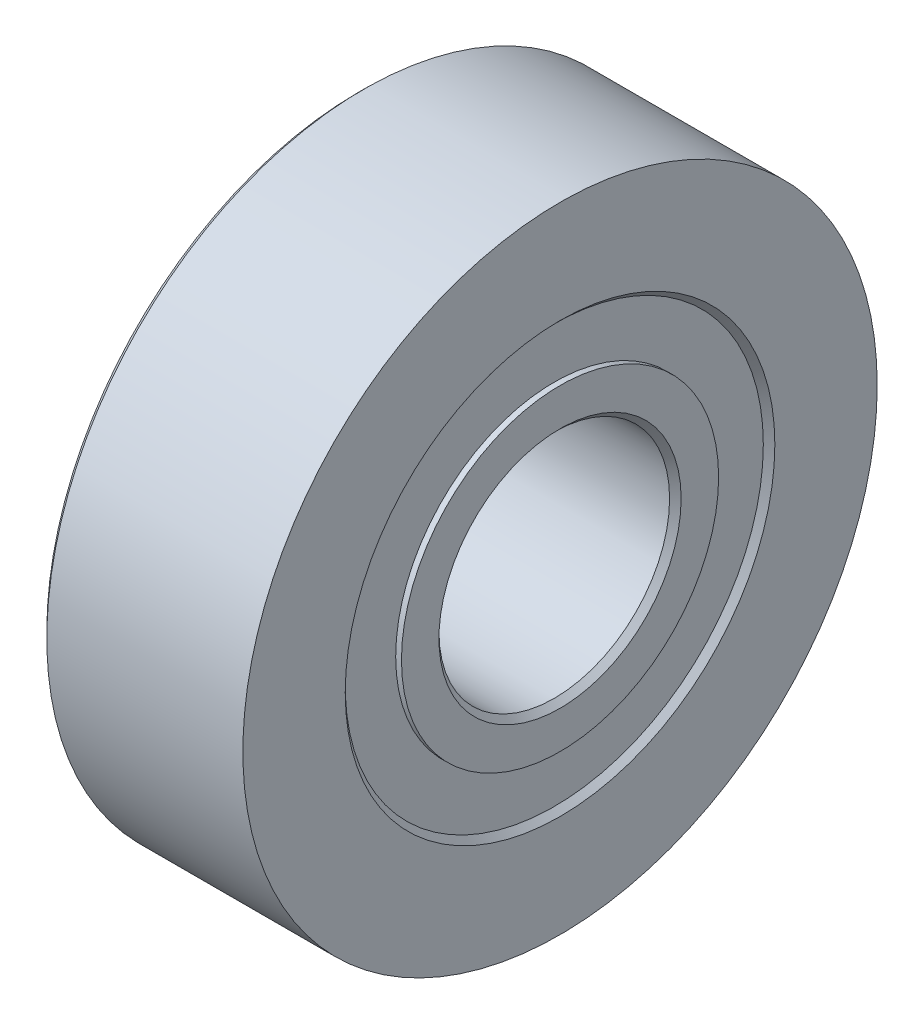
ISO-10303-21;
HEADER;
FILE_DESCRIPTION(('STEP AP214'),'2;1');
FILE_NAME('part.step','',(''),(''),'','','');
FILE_SCHEMA(('AUTOMOTIVE_DESIGN { 1 0 10303 214 1 1 1 1 }'));
ENDSEC;
DATA;
#1=APPLICATION_CONTEXT('core data for automotive mechanical design processes');
#2=APPLICATION_PROTOCOL_DEFINITION('international standard','automotive_design',2000,#1);
#3=PRODUCT_CONTEXT('',#1,'mechanical');
#4=PRODUCT('Part','Part','',(#3));
#5=PRODUCT_RELATED_PRODUCT_CATEGORY('part','',(#4));
#6=PRODUCT_DEFINITION_FORMATION('','',#4);
#7=PRODUCT_DEFINITION_CONTEXT('part definition',#1,'design');
#8=PRODUCT_DEFINITION('design','',#6,#7);
#9=PRODUCT_DEFINITION_SHAPE('','',#8);
#10=(LENGTH_UNIT() NAMED_UNIT(*) SI_UNIT(.MILLI.,.METRE.));
#11=(NAMED_UNIT(*) PLANE_ANGLE_UNIT() SI_UNIT($,.RADIAN.));
#12=(NAMED_UNIT(*) SI_UNIT($,.STERADIAN.) SOLID_ANGLE_UNIT());
#13=UNCERTAINTY_MEASURE_WITH_UNIT(LENGTH_MEASURE(1.E-05),#10,'distance_accuracy_value','');
#14=(GEOMETRIC_REPRESENTATION_CONTEXT(3) GLOBAL_UNCERTAINTY_ASSIGNED_CONTEXT((#13)) GLOBAL_UNIT_ASSIGNED_CONTEXT((#10,
#11,#12)) REPRESENTATION_CONTEXT('',''));
#15=CARTESIAN_POINT('',(0.,0.,0.));
#16=DIRECTION('',(0.,0.,1.));
#17=DIRECTION('',(1.,0.,0.));
#18=AXIS2_PLACEMENT_3D('',#15,#16,#17);
#19=CARTESIAN_POINT('',(-3.5,0.,0.));
#20=DIRECTION('',(1.,0.,0.));
#21=DIRECTION('',(0.,0.,-1.));
#22=AXIS2_PLACEMENT_3D('',#19,#20,#21);
#23=PLANE('',#22);
#24=CARTESIAN_POINT('',(-3.5,0.,0.));
#25=DIRECTION('',(1.,0.,0.));
#26=DIRECTION('',(0.,0.,-1.));
#27=AXIS2_PLACEMENT_3D('',#24,#25,#26);
#28=CIRCLE('',#27,4.2);
#29=CARTESIAN_POINT('',(-3.5,0.,-4.2));
#30=VERTEX_POINT('',#29);
#31=EDGE_CURVE('E43',#30,#30,#28,.T.);
#32=ORIENTED_EDGE('',*,*,#31,.T.);
#33=EDGE_LOOP('',(#32));
#34=FACE_BOUND('',#33,.T.);
#35=CARTESIAN_POINT('',(-3.5,0.,0.));
#36=DIRECTION('',(1.,0.,0.));
#37=DIRECTION('',(0.,0.,-1.));
#38=AXIS2_PLACEMENT_3D('',#35,#36,#37);
#39=CIRCLE('',#38,5.5);
#40=CARTESIAN_POINT('',(-3.5,0.,-5.5));
#41=VERTEX_POINT('',#40);
#42=EDGE_CURVE('E80',#41,#41,#39,.T.);
#43=ORIENTED_EDGE('',*,*,#42,.F.);
#44=EDGE_LOOP('',(#43));
#45=FACE_BOUND('',#44,.T.);
#46=ADVANCED_FACE('F32',(#34,#45),#23,.F.);
#47=CARTESIAN_POINT('',(3.5,0.,0.));
#48=DIRECTION('',(1.,0.,0.));
#49=DIRECTION('',(0.,0.,-1.));
#50=AXIS2_PLACEMENT_3D('',#47,#48,#49);
#51=PLANE('',#50);
#52=CARTESIAN_POINT('',(3.5,0.,0.));
#53=DIRECTION('',(1.,0.,0.));
#54=DIRECTION('',(0.,0.,-1.));
#55=AXIS2_PLACEMENT_3D('',#52,#53,#54);
#56=CIRCLE('',#55,4.2);
#57=CARTESIAN_POINT('',(3.5,0.,-4.2));
#58=VERTEX_POINT('',#57);
#59=EDGE_CURVE('E47',#58,#58,#56,.F.);
#60=ORIENTED_EDGE('',*,*,#59,.T.);
#61=EDGE_LOOP('',(#60));
#62=FACE_BOUND('',#61,.T.);
#63=CARTESIAN_POINT('',(3.5,0.,0.));
#64=DIRECTION('',(1.,0.,0.));
#65=DIRECTION('',(0.,0.,-1.));
#66=AXIS2_PLACEMENT_3D('',#63,#64,#65);
#67=CIRCLE('',#66,5.5);
#68=CARTESIAN_POINT('',(3.5,0.,-5.5));
#69=VERTEX_POINT('',#68);
#70=EDGE_CURVE('E68',#69,#69,#67,.T.);
#71=ORIENTED_EDGE('',*,*,#70,.T.);
#72=EDGE_LOOP('',(#71));
#73=FACE_BOUND('',#72,.T.);
#74=ADVANCED_FACE('F97',(#62,#73),#51,.T.);
#75=CARTESIAN_POINT('',(3.5,0.,0.));
#76=DIRECTION('',(-1.,0.,0.));
#77=DIRECTION('',(0.,0.,1.));
#78=AXIS2_PLACEMENT_3D('',#75,#76,#77);
#79=CYLINDRICAL_SURFACE('',#78,11.);
#80=CARTESIAN_POINT('',(-3.3,0.,0.));
#81=DIRECTION('',(1.,0.,0.));
#82=DIRECTION('',(0.,0.,-1.));
#83=AXIS2_PLACEMENT_3D('',#80,#81,#82);
#84=CIRCLE('',#83,11.);
#85=CARTESIAN_POINT('',(-3.3,0.,-11.));
#86=VERTEX_POINT('',#85);
#87=EDGE_CURVE('E39',#86,#86,#84,.T.);
#88=ORIENTED_EDGE('',*,*,#87,.T.);
#89=EDGE_LOOP('',(#88));
#90=FACE_BOUND('',#89,.T.);
#91=CARTESIAN_POINT('',(3.5,0.,0.));
#92=DIRECTION('',(1.,0.,0.));
#93=DIRECTION('',(0.,0.,-1.));
#94=AXIS2_PLACEMENT_3D('',#91,#92,#93);
#95=CIRCLE('',#94,11.);
#96=CARTESIAN_POINT('',(3.5,0.,-11.));
#97=VERTEX_POINT('',#96);
#98=EDGE_CURVE('E61',#97,#97,#95,.T.);
#99=ORIENTED_EDGE('',*,*,#98,.F.);
#100=EDGE_LOOP('',(#99));
#101=FACE_BOUND('',#100,.T.);
#102=ADVANCED_FACE('F104',(#90,#101),#79,.T.);
#103=CARTESIAN_POINT('',(3.5,0.,0.));
#104=DIRECTION('',(1.,0.,0.));
#105=DIRECTION('',(0.,0.,-1.));
#106=AXIS2_PLACEMENT_3D('',#103,#104,#105);
#107=CIRCLE('',#106,7.45000000000001);
#108=CARTESIAN_POINT('',(3.5,0.,-7.45000000000001));
#109=VERTEX_POINT('',#108);
#110=EDGE_CURVE('E58',#109,#109,#107,.F.);
#111=ORIENTED_EDGE('',*,*,#110,.T.);
#112=EDGE_LOOP('',(#111));
#113=FACE_BOUND('',#112,.T.);
#114=ORIENTED_EDGE('',*,*,#98,.T.);
#115=EDGE_LOOP('',(#114));
#116=FACE_BOUND('',#115,.T.);
#117=ADVANCED_FACE('F107',(#113,#116),#51,.T.);
#118=CARTESIAN_POINT('',(-3.5,0.,0.));
#119=DIRECTION('',(1.,0.,0.));
#120=DIRECTION('',(0.,0.,-1.));
#121=AXIS2_PLACEMENT_3D('',#118,#119,#120);
#122=CIRCLE('',#121,10.8);
#123=CARTESIAN_POINT('',(-3.5,0.,-10.8));
#124=VERTEX_POINT('',#123);
#125=EDGE_CURVE('E10',#124,#124,#122,.F.);
#126=ORIENTED_EDGE('',*,*,#125,.T.);
#127=EDGE_LOOP('',(#126));
#128=FACE_BOUND('',#127,.T.);
#129=CARTESIAN_POINT('',(-3.5,0.,0.));
#130=DIRECTION('',(1.,0.,0.));
#131=DIRECTION('',(0.,0.,-1.));
#132=AXIS2_PLACEMENT_3D('',#129,#130,#131);
#133=CIRCLE('',#132,7.25);
#134=CARTESIAN_POINT('',(-3.5,0.,-7.25));
#135=VERTEX_POINT('',#134);
#136=EDGE_CURVE('E74',#135,#135,#133,.T.);
#137=ORIENTED_EDGE('',*,*,#136,.T.);
#138=EDGE_LOOP('',(#137));
#139=FACE_BOUND('',#138,.T.);
#140=ADVANCED_FACE('F100',(#128,#139),#23,.F.);
#141=CARTESIAN_POINT('',(-3.5,0.,0.));
#142=DIRECTION('',(1.,0.,0.));
#143=DIRECTION('',(0.,0.,-1.));
#144=AXIS2_PLACEMENT_3D('',#141,#142,#143);
#145=CYLINDRICAL_SURFACE('',#144,4.);
#146=CARTESIAN_POINT('',(3.3,0.,0.));
#147=DIRECTION('',(1.,0.,0.));
#148=DIRECTION('',(0.,0.,-1.));
#149=AXIS2_PLACEMENT_3D('',#146,#147,#148);
#150=CIRCLE('',#149,4.);
#151=CARTESIAN_POINT('',(3.3,0.,-4.));
#152=VERTEX_POINT('',#151);
#153=EDGE_CURVE('E52',#152,#152,#150,.T.);
#154=ORIENTED_EDGE('',*,*,#153,.T.);
#155=EDGE_LOOP('',(#154));
#156=FACE_BOUND('',#155,.T.);
#157=CARTESIAN_POINT('',(-3.3,0.,0.));
#158=DIRECTION('',(1.,0.,0.));
#159=DIRECTION('',(0.,0.,-1.));
#160=AXIS2_PLACEMENT_3D('',#157,#158,#159);
#161=CIRCLE('',#160,4.);
#162=CARTESIAN_POINT('',(-3.3,0.,-4.));
#163=VERTEX_POINT('',#162);
#164=EDGE_CURVE('E55',#163,#163,#161,.F.);
#165=ORIENTED_EDGE('',*,*,#164,.T.);
#166=EDGE_LOOP('',(#165));
#167=FACE_BOUND('',#166,.T.);
#168=ADVANCED_FACE('F110',(#156,#167),#145,.F.);
#169=CARTESIAN_POINT('',(3.3,0.,0.));
#170=DIRECTION('',(1.,0.,0.));
#171=DIRECTION('',(0.,0.,-1.));
#172=AXIS2_PLACEMENT_3D('',#169,#170,#171);
#173=PLANE('',#172);
#174=CARTESIAN_POINT('',(3.3,0.,0.));
#175=DIRECTION('',(1.,0.,0.));
#176=DIRECTION('',(0.,0.,-1.));
#177=AXIS2_PLACEMENT_3D('',#174,#175,#176);
#178=CIRCLE('',#177,5.5);
#179=CARTESIAN_POINT('',(3.3,0.,-5.5));
#180=VERTEX_POINT('',#179);
#181=EDGE_CURVE('E67',#180,#180,#178,.T.);
#182=ORIENTED_EDGE('',*,*,#181,.F.);
#183=EDGE_LOOP('',(#182));
#184=FACE_BOUND('',#183,.T.);
#185=CARTESIAN_POINT('',(3.3,0.,0.));
#186=DIRECTION('',(1.,0.,0.));
#187=DIRECTION('',(0.,0.,-1.));
#188=AXIS2_PLACEMENT_3D('',#185,#186,#187);
#189=CIRCLE('',#188,7.25);
#190=CARTESIAN_POINT('',(3.3,0.,-7.25));
#191=VERTEX_POINT('',#190);
#192=EDGE_CURVE('E64',#191,#191,#189,.T.);
#193=ORIENTED_EDGE('',*,*,#192,.T.);
#194=EDGE_LOOP('',(#193));
#195=FACE_BOUND('',#194,.T.);
#196=ADVANCED_FACE('F115',(#184,#195),#173,.T.);
#197=CARTESIAN_POINT('',(3.3,0.,0.));
#198=DIRECTION('',(1.,0.,0.));
#199=DIRECTION('',(0.,0.,-1.));
#200=AXIS2_PLACEMENT_3D('',#197,#198,#199);
#201=CYLINDRICAL_SURFACE('',#200,5.5);
#202=ORIENTED_EDGE('',*,*,#181,.T.);
#203=EDGE_LOOP('',(#202));
#204=FACE_BOUND('',#203,.T.);
#205=ORIENTED_EDGE('',*,*,#70,.F.);
#206=EDGE_LOOP('',(#205));
#207=FACE_BOUND('',#206,.T.);
#208=ADVANCED_FACE('F128',(#204,#207),#201,.T.);
#209=CARTESIAN_POINT('',(-3.3,0.,0.));
#210=DIRECTION('',(-1.,0.,0.));
#211=DIRECTION('',(0.,0.,-1.));
#212=AXIS2_PLACEMENT_3D('',#209,#210,#211);
#213=PLANE('',#212);
#214=CARTESIAN_POINT('',(-3.3,0.,0.));
#215=DIRECTION('',(1.,0.,0.));
#216=DIRECTION('',(0.,0.,-1.));
#217=AXIS2_PLACEMENT_3D('',#214,#215,#216);
#218=CIRCLE('',#217,7.25);
#219=CARTESIAN_POINT('',(-3.3,0.,-7.25));
#220=VERTEX_POINT('',#219);
#221=EDGE_CURVE('E71',#220,#220,#218,.T.);
#222=ORIENTED_EDGE('',*,*,#221,.F.);
#223=EDGE_LOOP('',(#222));
#224=FACE_BOUND('',#223,.T.);
#225=CARTESIAN_POINT('',(-3.3,0.,0.));
#226=DIRECTION('',(1.,0.,0.));
#227=DIRECTION('',(0.,0.,-1.));
#228=AXIS2_PLACEMENT_3D('',#225,#226,#227);
#229=CIRCLE('',#228,5.5);
#230=CARTESIAN_POINT('',(-3.3,0.,-5.5));
#231=VERTEX_POINT('',#230);
#232=EDGE_CURVE('E77',#231,#231,#229,.T.);
#233=ORIENTED_EDGE('',*,*,#232,.T.);
#234=EDGE_LOOP('',(#233));
#235=FACE_BOUND('',#234,.T.);
#236=ADVANCED_FACE('F86',(#224,#235),#213,.T.);
#237=CARTESIAN_POINT('',(-3.3,0.,0.));
#238=DIRECTION('',(-1.,0.,0.));
#239=DIRECTION('',(0.,0.,1.));
#240=AXIS2_PLACEMENT_3D('',#237,#238,#239);
#241=CYLINDRICAL_SURFACE('',#240,7.25);
#242=ORIENTED_EDGE('',*,*,#221,.T.);
#243=EDGE_LOOP('',(#242));
#244=FACE_BOUND('',#243,.T.);
#245=ORIENTED_EDGE('',*,*,#136,.F.);
#246=EDGE_LOOP('',(#245));
#247=FACE_BOUND('',#246,.T.);
#248=ADVANCED_FACE('F92',(#244,#247),#241,.F.);
#249=CARTESIAN_POINT('',(-3.3,0.,0.));
#250=DIRECTION('',(-1.,0.,0.));
#251=DIRECTION('',(0.,0.,1.));
#252=AXIS2_PLACEMENT_3D('',#249,#250,#251);
#253=CYLINDRICAL_SURFACE('',#252,5.5);
#254=ORIENTED_EDGE('',*,*,#232,.F.);
#255=EDGE_LOOP('',(#254));
#256=FACE_BOUND('',#255,.T.);
#257=ORIENTED_EDGE('',*,*,#42,.T.);
#258=EDGE_LOOP('',(#257));
#259=FACE_BOUND('',#258,.T.);
#260=ADVANCED_FACE('F88',(#256,#259),#253,.T.);
#261=CARTESIAN_POINT('',(3.29999999999999,0.,0.));
#262=DIRECTION('',(1.,0.,0.));
#263=DIRECTION('',(0.,0.,-1.));
#264=AXIS2_PLACEMENT_3D('',#261,#262,#263);
#265=CONICAL_SURFACE('',#264,7.25,0.785398163397444);
#266=ORIENTED_EDGE('',*,*,#110,.F.);
#267=EDGE_LOOP('',(#266));
#268=FACE_BOUND('',#267,.T.);
#269=ORIENTED_EDGE('',*,*,#192,.F.);
#270=EDGE_LOOP('',(#269));
#271=FACE_BOUND('',#270,.T.);
#272=ADVANCED_FACE('F91',(#268,#271),#265,.F.);
#273=CARTESIAN_POINT('',(3.3,0.,0.));
#274=DIRECTION('',(1.,0.,0.));
#275=DIRECTION('',(0.,0.,-1.));
#276=AXIS2_PLACEMENT_3D('',#273,#274,#275);
#277=CONICAL_SURFACE('',#276,4.,0.785398163397446);
#278=CARTESIAN_POINT('',(3.5,0.,-4.2));
#279=CARTESIAN_POINT('',(3.49791666666667,0.,-4.19791666666667));
#280=CARTESIAN_POINT('',(3.49583333333333,0.,-4.19583333333333));
#281=CARTESIAN_POINT('',(3.49166666666667,0.,-4.19166666666667));
#282=CARTESIAN_POINT('',(3.48958333333333,0.,-4.18958333333333));
#283=CARTESIAN_POINT('',(3.48541666666667,0.,-4.18541666666667));
#284=CARTESIAN_POINT('',(3.48333333333333,0.,-4.18333333333333));
#285=CARTESIAN_POINT('',(3.47916666666667,0.,-4.17916666666667));
#286=CARTESIAN_POINT('',(3.47708333333333,0.,-4.17708333333333));
#287=CARTESIAN_POINT('',(3.47291666666667,0.,-4.17291666666667));
#288=CARTESIAN_POINT('',(3.47083333333333,0.,-4.17083333333333));
#289=CARTESIAN_POINT('',(3.46666666666667,0.,-4.16666666666667));
#290=CARTESIAN_POINT('',(3.46458333333333,0.,-4.16458333333333));
#291=CARTESIAN_POINT('',(3.46041666666667,0.,-4.16041666666667));
#292=CARTESIAN_POINT('',(3.45833333333333,0.,-4.15833333333333));
#293=CARTESIAN_POINT('',(3.45416666666667,0.,-4.15416666666667));
#294=CARTESIAN_POINT('',(3.45208333333333,0.,-4.15208333333333));
#295=CARTESIAN_POINT('',(3.44791666666667,0.,-4.14791666666667));
#296=CARTESIAN_POINT('',(3.44583333333333,0.,-4.14583333333333));
#297=CARTESIAN_POINT('',(3.44166666666667,0.,-4.14166666666667));
#298=CARTESIAN_POINT('',(3.43958333333333,0.,-4.13958333333333));
#299=CARTESIAN_POINT('',(3.43541666666667,0.,-4.13541666666667));
#300=CARTESIAN_POINT('',(3.43333333333333,0.,-4.13333333333333));
#301=CARTESIAN_POINT('',(3.42916666666667,0.,-4.12916666666667));
#302=CARTESIAN_POINT('',(3.42708333333333,0.,-4.12708333333333));
#303=CARTESIAN_POINT('',(3.42291666666667,0.,-4.12291666666667));
#304=CARTESIAN_POINT('',(3.42083333333333,0.,-4.12083333333333));
#305=CARTESIAN_POINT('',(3.41666666666667,0.,-4.11666666666667));
#306=CARTESIAN_POINT('',(3.41458333333333,0.,-4.11458333333333));
#307=CARTESIAN_POINT('',(3.41041666666667,0.,-4.11041666666667));
#308=CARTESIAN_POINT('',(3.40833333333333,0.,-4.10833333333333));
#309=CARTESIAN_POINT('',(3.40416666666667,0.,-4.10416666666667));
#310=CARTESIAN_POINT('',(3.40208333333333,0.,-4.10208333333333));
#311=CARTESIAN_POINT('',(3.39791666666667,0.,-4.09791666666667));
#312=CARTESIAN_POINT('',(3.39583333333333,0.,-4.09583333333333));
#313=CARTESIAN_POINT('',(3.39166666666667,0.,-4.09166666666667));
#314=CARTESIAN_POINT('',(3.38958333333333,0.,-4.08958333333333));
#315=CARTESIAN_POINT('',(3.38541666666667,0.,-4.08541666666667));
#316=CARTESIAN_POINT('',(3.38333333333333,0.,-4.08333333333333));
#317=CARTESIAN_POINT('',(3.37916666666667,0.,-4.07916666666667));
#318=CARTESIAN_POINT('',(3.37708333333333,0.,-4.07708333333333));
#319=CARTESIAN_POINT('',(3.37291666666667,0.,-4.07291666666667));
#320=CARTESIAN_POINT('',(3.37083333333333,0.,-4.07083333333333));
#321=CARTESIAN_POINT('',(3.36666666666667,0.,-4.06666666666667));
#322=CARTESIAN_POINT('',(3.36458333333333,0.,-4.06458333333333));
#323=CARTESIAN_POINT('',(3.36041666666667,0.,-4.06041666666667));
#324=CARTESIAN_POINT('',(3.35833333333333,0.,-4.05833333333333));
#325=CARTESIAN_POINT('',(3.35416666666667,0.,-4.05416666666667));
#326=CARTESIAN_POINT('',(3.35208333333333,0.,-4.05208333333333));
#327=CARTESIAN_POINT('',(3.34791666666667,0.,-4.04791666666667));
#328=CARTESIAN_POINT('',(3.34583333333333,0.,-4.04583333333333));
#329=CARTESIAN_POINT('',(3.34166666666667,0.,-4.04166666666667));
#330=CARTESIAN_POINT('',(3.33958333333333,0.,-4.03958333333333));
#331=CARTESIAN_POINT('',(3.33541666666667,0.,-4.03541666666667));
#332=CARTESIAN_POINT('',(3.33333333333333,0.,-4.03333333333333));
#333=CARTESIAN_POINT('',(3.32916666666667,0.,-4.02916666666667));
#334=CARTESIAN_POINT('',(3.32708333333333,0.,-4.02708333333333));
#335=CARTESIAN_POINT('',(3.32291666666667,0.,-4.02291666666667));
#336=CARTESIAN_POINT('',(3.32083333333333,0.,-4.02083333333333));
#337=CARTESIAN_POINT('',(3.31666666666667,0.,-4.01666666666667));
#338=CARTESIAN_POINT('',(3.31458333333333,0.,-4.01458333333333));
#339=CARTESIAN_POINT('',(3.31041666666667,0.,-4.01041666666667));
#340=CARTESIAN_POINT('',(3.30833333333333,0.,-4.00833333333333));
#341=CARTESIAN_POINT('',(3.30416666666667,0.,-4.00416666666667));
#342=CARTESIAN_POINT('',(3.30208333333333,0.,-4.00208333333333));
#343=CARTESIAN_POINT('',(3.3,0.,-4.));
#344=B_SPLINE_CURVE_WITH_KNOTS('',3,(#278,#279,#280,#281,#282,#283,#284,#285,#286,#287,#288,
#289,#290,#291,#292,#293,#294,#295,#296,#297,#298,#299,#300,#301,#302,#303,#304,#305,#306,#307,
#308,#309,#310,#311,#312,#313,#314,#315,#316,#317,#318,#319,#320,#321,#322,#323,#324,#325,#326,
#327,#328,#329,#330,#331,#332,#333,#334,#335,#336,#337,#338,#339,#340,#341,#342,#343),
.UNSPECIFIED.,.F.,.F.,(4,2,2,2,2,2,2,2,2,2,2,2,2,2,2,2,2,2,2,2,2,2,2,2,2,2,2,2,2,2,2,2,4),(0.,
0.0088388347648321,0.0176776695296642,0.0265165042944954,0.0353553390593275,0.0441941738241593,
0.0530330085889914,0.0618718433538231,0.0707106781186546,0.0795495128834867,0.0883883476483185,
0.09722718241315,0.106066017177982,0.114904851942814,0.123743686707646,0.132582521472477,
0.141421356237309,0.150260191002141,0.159099025766973,0.167937860531804,0.176776695296636,
0.185615530061468,0.1944543648263,0.203293199591132,0.212132034355964,0.220970869120796,
0.229809703885628,0.238648538650459,0.247487373415291,0.256326208180123,0.265165042944955,
0.274003877709787,0.282842712474618),.UNSPECIFIED.);
#345=EDGE_CURVE('BSEAM144',#58,#152,#344,.T.);
#346=ORIENTED_EDGE('',*,*,#59,.F.);
#347=ORIENTED_EDGE('',*,*,#153,.F.);
#348=ORIENTED_EDGE('',*,*,#345,.T.);
#349=ORIENTED_EDGE('',*,*,#345,.F.);
#350=EDGE_LOOP('',(#346,#348,#347,#349));
#351=FACE_BOUND('',#350,.T.);
#352=ADVANCED_FACE('F144',(#351),#277,.F.);
#353=CARTESIAN_POINT('',(-3.5,0.,0.));
#354=DIRECTION('',(-1.,0.,0.));
#355=DIRECTION('',(0.,0.,1.));
#356=AXIS2_PLACEMENT_3D('',#353,#354,#355);
#357=CONICAL_SURFACE('',#356,4.2,0.78539816339744);
#358=ORIENTED_EDGE('',*,*,#164,.F.);
#359=EDGE_LOOP('',(#358));
#360=FACE_BOUND('',#359,.T.);
#361=ORIENTED_EDGE('',*,*,#31,.F.);
#362=EDGE_LOOP('',(#361));
#363=FACE_BOUND('',#362,.T.);
#364=ADVANCED_FACE('F150',(#360,#363),#357,.F.);
#365=CARTESIAN_POINT('',(-3.3,0.,0.));
#366=DIRECTION('',(1.,0.,0.));
#367=DIRECTION('',(0.,0.,-1.));
#368=AXIS2_PLACEMENT_3D('',#365,#366,#367);
#369=CONICAL_SURFACE('',#368,11.,0.785398163397448);
#370=ORIENTED_EDGE('',*,*,#125,.F.);
#371=EDGE_LOOP('',(#370));
#372=FACE_BOUND('',#371,.T.);
#373=ORIENTED_EDGE('',*,*,#87,.F.);
#374=EDGE_LOOP('',(#373));
#375=FACE_BOUND('',#374,.T.);
#376=ADVANCED_FACE('F34',(#372,#375),#369,.T.);
#377=CLOSED_SHELL('',(#46,#74,#102,#117,#140,#168,#196,#208,#236,#248,#260,#272,#352,#364,#376));
#378=MANIFOLD_SOLID_BREP('B2',#377);
#379=ADVANCED_BREP_SHAPE_REPRESENTATION('',(#18,#378),#14);
#380=SHAPE_DEFINITION_REPRESENTATION(#9,#379);
ENDSEC;
END-ISO-10303-21;
